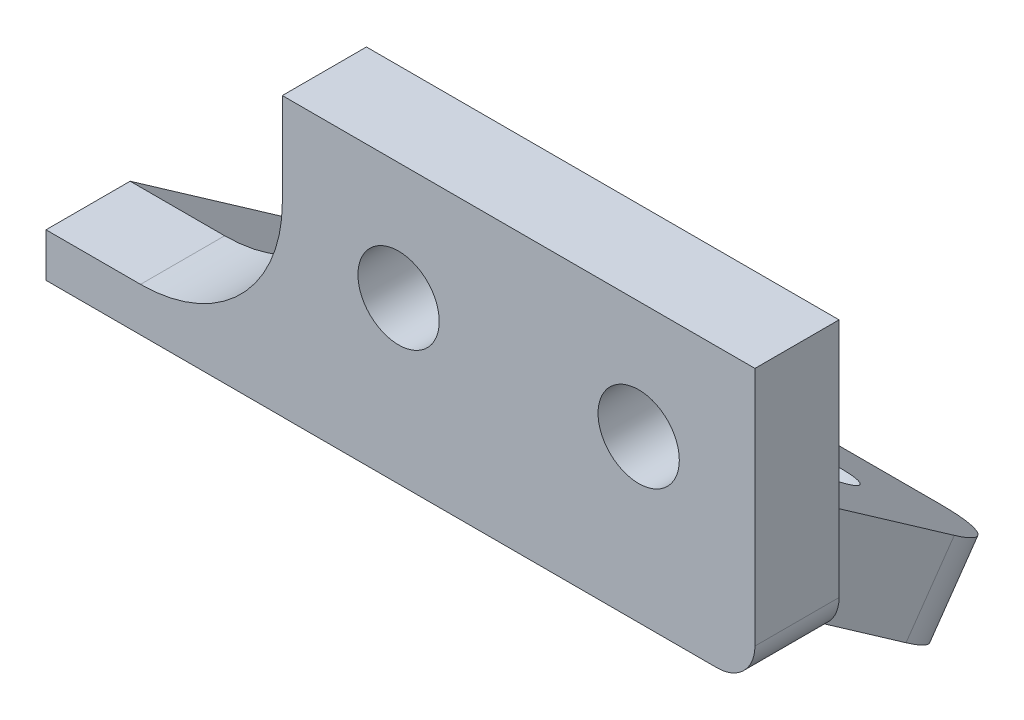
ISO-10303-21;
HEADER;
FILE_DESCRIPTION(('STEP AP214'),'2;1');
FILE_NAME('part.step','',(''),(''),'','','');
FILE_SCHEMA(('AUTOMOTIVE_DESIGN { 1 0 10303 214 1 1 1 1 }'));
ENDSEC;
DATA;
#1=APPLICATION_CONTEXT('core data for automotive mechanical design processes');
#2=APPLICATION_PROTOCOL_DEFINITION('international standard','automotive_design',2000,#1);
#3=PRODUCT_CONTEXT('',#1,'mechanical');
#4=PRODUCT('Part','Part','',(#3));
#5=PRODUCT_RELATED_PRODUCT_CATEGORY('part','',(#4));
#6=PRODUCT_DEFINITION_FORMATION('','',#4);
#7=PRODUCT_DEFINITION_CONTEXT('part definition',#1,'design');
#8=PRODUCT_DEFINITION('design','',#6,#7);
#9=PRODUCT_DEFINITION_SHAPE('','',#8);
#10=(LENGTH_UNIT() NAMED_UNIT(*) SI_UNIT(.MILLI.,.METRE.));
#11=(NAMED_UNIT(*) PLANE_ANGLE_UNIT() SI_UNIT($,.RADIAN.));
#12=(NAMED_UNIT(*) SI_UNIT($,.STERADIAN.) SOLID_ANGLE_UNIT());
#13=UNCERTAINTY_MEASURE_WITH_UNIT(LENGTH_MEASURE(1.E-05),#10,'distance_accuracy_value','');
#14=(GEOMETRIC_REPRESENTATION_CONTEXT(3) GLOBAL_UNCERTAINTY_ASSIGNED_CONTEXT((#13)) GLOBAL_UNIT_ASSIGNED_CONTEXT((#10,
#11,#12)) REPRESENTATION_CONTEXT('',''));
#15=CARTESIAN_POINT('',(0.,0.,0.));
#16=DIRECTION('',(0.,0.,1.));
#17=DIRECTION('',(1.,0.,0.));
#18=AXIS2_PLACEMENT_3D('',#15,#16,#17);
#19=CARTESIAN_POINT('',(0.,0.,-4.45));
#20=DIRECTION('',(0.,0.,1.));
#21=DIRECTION('',(-1.,0.,0.));
#22=AXIS2_PLACEMENT_3D('',#19,#20,#21);
#23=PLANE('',#22);
#24=CARTESIAN_POINT('',(6.35000000000059,0.,-4.45));
#25=DIRECTION('',(0.,0.,1.));
#26=DIRECTION('',(1.,0.,0.));
#27=AXIS2_PLACEMENT_3D('',#24,#25,#26);
#28=CIRCLE('',#27,2.14999999999969);
#29=CARTESIAN_POINT('',(8.50000000000028,0.,-4.45));
#30=VERTEX_POINT('',#29);
#31=EDGE_CURVE('E188',#30,#30,#28,.T.);
#32=ORIENTED_EDGE('',*,*,#31,.T.);
#33=EDGE_LOOP('',(#32));
#34=FACE_BOUND('',#33,.T.);
#35=CARTESIAN_POINT('',(-6.35000000000035,-1.21430643318376E-12,-4.45));
#36=DIRECTION('',(0.,0.,1.));
#37=DIRECTION('',(1.,0.,0.));
#38=AXIS2_PLACEMENT_3D('',#35,#36,#37);
#39=CIRCLE('',#38,2.15000000000069);
#40=CARTESIAN_POINT('',(-4.19999999999966,-1.21430643318376E-12,-4.45));
#41=VERTEX_POINT('',#40);
#42=EDGE_CURVE('E194',#41,#41,#39,.T.);
#43=ORIENTED_EDGE('',*,*,#42,.T.);
#44=EDGE_LOOP('',(#43));
#45=FACE_BOUND('',#44,.T.);
#46=DIRECTION('',(1.,0.,0.));
#47=VECTOR('',#46,1.);
#48=CARTESIAN_POINT('',(12.5000000000001,-8.52,-4.45));
#49=LINE('',#48,#47);
#50=CARTESIAN_POINT('',(7.50000000000012,-8.52,-4.45));
#51=VERTEX_POINT('',#50);
#52=CARTESIAN_POINT('',(10.5000000000001,-8.52,-4.45));
#53=VERTEX_POINT('',#52);
#54=EDGE_CURVE('E203',#51,#53,#49,.T.);
#55=ORIENTED_EDGE('',*,*,#54,.F.);
#56=DIRECTION('',(0.,1.,0.));
#57=VECTOR('',#56,1.);
#58=CARTESIAN_POINT('',(7.50000000000012,-8.52,-4.45));
#59=LINE('',#58,#57);
#60=CARTESIAN_POINT('',(7.50000000000012,-6.2,-4.45));
#61=VERTEX_POINT('',#60);
#62=EDGE_CURVE('E237',#61,#51,#59,.F.);
#63=ORIENTED_EDGE('',*,*,#62,.F.);
#64=DIRECTION('',(1.,0.,0.));
#65=VECTOR('',#64,1.);
#66=CARTESIAN_POINT('',(-24.9999999999999,-6.2,-4.45));
#67=LINE('',#66,#65);
#68=CARTESIAN_POINT('',(-19.9999999999999,-6.2,-4.45));
#69=VERTEX_POINT('',#68);
#70=EDGE_CURVE('E180',#69,#61,#67,.T.);
#71=ORIENTED_EDGE('',*,*,#70,.F.);
#72=CARTESIAN_POINT('',(-19.9999999999999,1.3,-4.45));
#73=DIRECTION('',(0.,0.,-1.));
#74=DIRECTION('',(-1.,0.,0.));
#75=AXIS2_PLACEMENT_3D('',#72,#73,#74);
#76=CIRCLE('',#75,7.5);
#77=CARTESIAN_POINT('',(-12.4999999999999,1.3,-4.45));
#78=VERTEX_POINT('',#77);
#79=EDGE_CURVE('E253',#78,#69,#76,.T.);
#80=ORIENTED_EDGE('',*,*,#79,.F.);
#81=DIRECTION('',(0.,-1.,0.));
#82=VECTOR('',#81,1.);
#83=CARTESIAN_POINT('',(-12.4999999999999,-8.52,-4.45));
#84=LINE('',#83,#82);
#85=CARTESIAN_POINT('',(-12.4999999999999,6.2,-4.45));
#86=VERTEX_POINT('',#85);
#87=EDGE_CURVE('E200',#86,#78,#84,.T.);
#88=ORIENTED_EDGE('',*,*,#87,.F.);
#89=DIRECTION('',(-1.,0.,0.));
#90=VECTOR('',#89,1.);
#91=CARTESIAN_POINT('',(-12.4999999999999,6.2,-4.45));
#92=LINE('',#91,#90);
#93=CARTESIAN_POINT('',(12.5000000000001,6.2,-4.45));
#94=VERTEX_POINT('',#93);
#95=EDGE_CURVE('E209',#94,#86,#92,.T.);
#96=ORIENTED_EDGE('',*,*,#95,.F.);
#97=DIRECTION('',(0.,1.,0.));
#98=VECTOR('',#97,1.);
#99=CARTESIAN_POINT('',(12.5000000000001,6.2,-4.45));
#100=LINE('',#99,#98);
#101=CARTESIAN_POINT('',(12.5000000000001,-6.52,-4.45));
#102=VERTEX_POINT('',#101);
#103=EDGE_CURVE('E206',#102,#94,#100,.T.);
#104=ORIENTED_EDGE('',*,*,#103,.F.);
#105=CARTESIAN_POINT('',(10.5000000000001,-6.52,-4.45));
#106=DIRECTION('',(0.,0.,-1.));
#107=DIRECTION('',(-1.,0.,0.));
#108=AXIS2_PLACEMENT_3D('',#105,#106,#107);
#109=CIRCLE('',#108,2.);
#110=EDGE_CURVE('E11',#53,#102,#109,.F.);
#111=ORIENTED_EDGE('',*,*,#110,.F.);
#112=EDGE_LOOP('',(#55,#63,#71,#80,#88,#96,#104,#111));
#113=FACE_BOUND('',#112,.T.);
#114=ADVANCED_FACE('F43',(#34,#45,#113),#23,.F.);
#115=CARTESIAN_POINT('',(-12.4999999999999,-8.52,-4.45));
#116=DIRECTION('',(1.,0.,0.));
#117=DIRECTION('',(0.,0.,1.));
#118=AXIS2_PLACEMENT_3D('',#115,#116,#117);
#119=PLANE('',#118);
#120=DIRECTION('',(0.,-1.,0.));
#121=VECTOR('',#120,1.);
#122=CARTESIAN_POINT('',(-12.4999999999999,-8.52,0.));
#123=LINE('',#122,#121);
#124=CARTESIAN_POINT('',(-12.4999999999999,6.2,0.));
#125=VERTEX_POINT('',#124);
#126=CARTESIAN_POINT('',(-12.4999999999999,1.3,0.));
#127=VERTEX_POINT('',#126);
#128=EDGE_CURVE('E213',#125,#127,#123,.T.);
#129=ORIENTED_EDGE('',*,*,#128,.F.);
#130=DIRECTION('',(0.,0.,1.));
#131=VECTOR('',#130,1.);
#132=CARTESIAN_POINT('',(-12.4999999999999,6.2,-4.45));
#133=LINE('',#132,#131);
#134=EDGE_CURVE('E212',#86,#125,#133,.T.);
#135=ORIENTED_EDGE('',*,*,#134,.F.);
#136=ORIENTED_EDGE('',*,*,#87,.T.);
#137=DIRECTION('',(0.,0.,1.));
#138=VECTOR('',#137,1.);
#139=CARTESIAN_POINT('',(-12.4999999999999,1.3,-4.45));
#140=LINE('',#139,#138);
#141=EDGE_CURVE('E244',#127,#78,#140,.F.);
#142=ORIENTED_EDGE('',*,*,#141,.F.);
#143=EDGE_LOOP('',(#129,#135,#136,#142));
#144=FACE_BOUND('',#143,.T.);
#145=ADVANCED_FACE('F321',(#144),#119,.F.);
#146=CARTESIAN_POINT('',(0.,0.,0.));
#147=DIRECTION('',(0.,0.,1.));
#148=DIRECTION('',(-1.,0.,0.));
#149=AXIS2_PLACEMENT_3D('',#146,#147,#148);
#150=PLANE('',#149);
#151=DIRECTION('',(0.,1.,0.));
#152=VECTOR('',#151,1.);
#153=CARTESIAN_POINT('',(12.5000000000001,6.2,0.));
#154=LINE('',#153,#152);
#155=CARTESIAN_POINT('',(12.5000000000001,-6.52,0.));
#156=VERTEX_POINT('',#155);
#157=CARTESIAN_POINT('',(12.5000000000001,6.2,0.));
#158=VERTEX_POINT('',#157);
#159=EDGE_CURVE('E219',#156,#158,#154,.T.);
#160=ORIENTED_EDGE('',*,*,#159,.T.);
#161=DIRECTION('',(-1.,0.,0.));
#162=VECTOR('',#161,1.);
#163=CARTESIAN_POINT('',(-12.4999999999999,6.2,0.));
#164=LINE('',#163,#162);
#165=EDGE_CURVE('E204',#158,#125,#164,.T.);
#166=ORIENTED_EDGE('',*,*,#165,.T.);
#167=ORIENTED_EDGE('',*,*,#128,.T.);
#168=CARTESIAN_POINT('',(-19.9999999999999,1.3,0.));
#169=DIRECTION('',(0.,0.,-1.));
#170=DIRECTION('',(-1.,0.,0.));
#171=AXIS2_PLACEMENT_3D('',#168,#169,#170);
#172=CIRCLE('',#171,7.5);
#173=CARTESIAN_POINT('',(-19.9999999999999,-6.2,0.));
#174=VERTEX_POINT('',#173);
#175=EDGE_CURVE('E251',#174,#127,#172,.F.);
#176=ORIENTED_EDGE('',*,*,#175,.F.);
#177=DIRECTION('',(1.,0.,0.));
#178=VECTOR('',#177,1.);
#179=CARTESIAN_POINT('',(-24.9999999999999,-6.2,0.));
#180=LINE('',#179,#178);
#181=CARTESIAN_POINT('',(-24.9999999999999,-6.2,0.));
#182=VERTEX_POINT('',#181);
#183=EDGE_CURVE('E184',#182,#174,#180,.T.);
#184=ORIENTED_EDGE('',*,*,#183,.F.);
#185=DIRECTION('',(0.,-1.,0.));
#186=VECTOR('',#185,1.);
#187=CARTESIAN_POINT('',(-24.9999999999999,0.,0.));
#188=LINE('',#187,#186);
#189=CARTESIAN_POINT('',(-24.9999999999999,-8.51652337495525,0.));
#190=VERTEX_POINT('',#189);
#191=EDGE_CURVE('E172',#182,#190,#188,.T.);
#192=ORIENTED_EDGE('',*,*,#191,.T.);
#193=DIRECTION('',(1.,0.,0.));
#194=VECTOR('',#193,1.);
#195=CARTESIAN_POINT('',(-24.9999999999999,-8.51652337495525,0.));
#196=LINE('',#195,#194);
#197=CARTESIAN_POINT('',(-12.4999999999999,-8.51652337495525,0.));
#198=VERTEX_POINT('',#197);
#199=EDGE_CURVE('E298',#190,#198,#196,.T.);
#200=ORIENTED_EDGE('',*,*,#199,.T.);
#201=CARTESIAN_POINT('',(-12.4999999999999,-8.52,0.));
#202=VERTEX_POINT('',#201);
#203=EDGE_CURVE('E197',#198,#202,#123,.T.);
#204=ORIENTED_EDGE('',*,*,#203,.T.);
#205=DIRECTION('',(1.,0.,0.));
#206=VECTOR('',#205,1.);
#207=CARTESIAN_POINT('',(12.5000000000001,-8.52,0.));
#208=LINE('',#207,#206);
#209=CARTESIAN_POINT('',(10.5000000000001,-8.52,0.));
#210=VERTEX_POINT('',#209);
#211=EDGE_CURVE('E216',#202,#210,#208,.T.);
#212=ORIENTED_EDGE('',*,*,#211,.T.);
#213=CARTESIAN_POINT('',(10.5000000000001,-6.52,0.));
#214=DIRECTION('',(0.,0.,-1.));
#215=DIRECTION('',(-1.,0.,0.));
#216=AXIS2_PLACEMENT_3D('',#213,#214,#215);
#217=CIRCLE('',#216,2.);
#218=EDGE_CURVE('E277',#156,#210,#217,.T.);
#219=ORIENTED_EDGE('',*,*,#218,.F.);
#220=EDGE_LOOP('',(#160,#166,#167,#176,#184,#192,#200,#204,#212,#219));
#221=FACE_BOUND('',#220,.T.);
#222=CARTESIAN_POINT('',(-6.35000000000035,-1.21430643318376E-12,0.));
#223=DIRECTION('',(0.,0.,1.));
#224=DIRECTION('',(1.,0.,0.));
#225=AXIS2_PLACEMENT_3D('',#222,#223,#224);
#226=CIRCLE('',#225,2.15000000000069);
#227=CARTESIAN_POINT('',(-4.19999999999966,-1.21430643318376E-12,0.));
#228=VERTEX_POINT('',#227);
#229=EDGE_CURVE('E191',#228,#228,#226,.T.);
#230=ORIENTED_EDGE('',*,*,#229,.F.);
#231=EDGE_LOOP('',(#230));
#232=FACE_BOUND('',#231,.T.);
#233=CARTESIAN_POINT('',(6.35000000000059,0.,0.));
#234=DIRECTION('',(0.,0.,1.));
#235=DIRECTION('',(1.,0.,0.));
#236=AXIS2_PLACEMENT_3D('',#233,#234,#235);
#237=CIRCLE('',#236,2.14999999999969);
#238=CARTESIAN_POINT('',(8.50000000000028,0.,0.));
#239=VERTEX_POINT('',#238);
#240=EDGE_CURVE('E182',#239,#239,#237,.T.);
#241=ORIENTED_EDGE('',*,*,#240,.F.);
#242=EDGE_LOOP('',(#241));
#243=FACE_BOUND('',#242,.T.);
#244=ADVANCED_FACE('F282',(#221,#232,#243),#150,.T.);
#245=DIRECTION('',(0.,0.,1.));
#246=VECTOR('',#245,1.);
#247=CARTESIAN_POINT('',(-12.4999999999999,-8.52,-4.45));
#248=LINE('',#247,#246);
#249=CARTESIAN_POINT('',(-12.4999999999999,-8.52,-0.00496513512784555));
#250=VERTEX_POINT('',#249);
#251=EDGE_CURVE('E227',#250,#202,#248,.T.);
#252=ORIENTED_EDGE('',*,*,#251,.T.);
#253=ORIENTED_EDGE('',*,*,#203,.F.);
#254=DIRECTION('',(0.,0.57357643635105,0.819152044288989));
#255=VECTOR('',#254,1.);
#256=CARTESIAN_POINT('',(-12.4999999999999,-10.6084832308282,-2.98762829834949));
#257=LINE('',#256,#255);
#258=EDGE_CURVE('E179',#250,#198,#257,.T.);
#259=ORIENTED_EDGE('',*,*,#258,.F.);
#260=EDGE_LOOP('',(#252,#253,#259));
#261=FACE_BOUND('',#260,.T.);
#262=ADVANCED_FACE('F292',(#261),#119,.F.);
#263=CARTESIAN_POINT('',(12.5000000000001,-8.52,-4.45));
#264=DIRECTION('',(0.,1.,0.));
#265=DIRECTION('',(0.,0.,-1.));
#266=AXIS2_PLACEMENT_3D('',#263,#264,#265);
#267=PLANE('',#266);
#268=ORIENTED_EDGE('',*,*,#211,.F.);
#269=ORIENTED_EDGE('',*,*,#251,.F.);
#270=DIRECTION('',(-1.,0.,0.));
#271=VECTOR('',#270,1.);
#272=CARTESIAN_POINT('',(12.5000000000001,-8.52,-0.00496513512784555));
#273=LINE('',#272,#271);
#274=CARTESIAN_POINT('',(7.50000000000012,-8.52,-0.00496513512784555));
#275=VERTEX_POINT('',#274);
#276=EDGE_CURVE('E229',#275,#250,#273,.T.);
#277=ORIENTED_EDGE('',*,*,#276,.F.);
#278=DIRECTION('',(0.,0.,-1.));
#279=VECTOR('',#278,1.);
#280=CARTESIAN_POINT('',(7.50000000000012,-8.52,-0.00496513512784468));
#281=LINE('',#280,#279);
#282=EDGE_CURVE('E240',#51,#275,#281,.F.);
#283=ORIENTED_EDGE('',*,*,#282,.F.);
#284=ORIENTED_EDGE('',*,*,#54,.T.);
#285=DIRECTION('',(0.,0.,1.));
#286=VECTOR('',#285,1.);
#287=CARTESIAN_POINT('',(10.5000000000001,-8.52,-4.45));
#288=LINE('',#287,#286);
#289=EDGE_CURVE('E51',#210,#53,#288,.F.);
#290=ORIENTED_EDGE('',*,*,#289,.F.);
#291=EDGE_LOOP('',(#268,#269,#277,#283,#284,#290));
#292=FACE_BOUND('',#291,.T.);
#293=ADVANCED_FACE('F287',(#292),#267,.F.);
#294=CARTESIAN_POINT('',(12.5000000000001,6.2,-4.45));
#295=DIRECTION('',(-1.,0.,0.));
#296=DIRECTION('',(0.,0.,-1.));
#297=AXIS2_PLACEMENT_3D('',#294,#295,#296);
#298=PLANE('',#297);
#299=ORIENTED_EDGE('',*,*,#103,.T.);
#300=DIRECTION('',(0.,0.,1.));
#301=VECTOR('',#300,1.);
#302=CARTESIAN_POINT('',(12.5000000000001,6.2,-4.45));
#303=LINE('',#302,#301);
#304=EDGE_CURVE('E225',#94,#158,#303,.T.);
#305=ORIENTED_EDGE('',*,*,#304,.T.);
#306=ORIENTED_EDGE('',*,*,#159,.F.);
#307=DIRECTION('',(0.,0.,1.));
#308=VECTOR('',#307,1.);
#309=CARTESIAN_POINT('',(12.5000000000001,-6.52,-4.45));
#310=LINE('',#309,#308);
#311=EDGE_CURVE('E275',#102,#156,#310,.T.);
#312=ORIENTED_EDGE('',*,*,#311,.F.);
#313=EDGE_LOOP('',(#299,#305,#306,#312));
#314=FACE_BOUND('',#313,.T.);
#315=ADVANCED_FACE('F313',(#314),#298,.F.);
#316=CARTESIAN_POINT('',(-12.4999999999999,6.2,-4.45));
#317=DIRECTION('',(0.,-1.,0.));
#318=DIRECTION('',(0.,0.,1.));
#319=AXIS2_PLACEMENT_3D('',#316,#317,#318);
#320=PLANE('',#319);
#321=ORIENTED_EDGE('',*,*,#165,.F.);
#322=ORIENTED_EDGE('',*,*,#304,.F.);
#323=ORIENTED_EDGE('',*,*,#95,.T.);
#324=ORIENTED_EDGE('',*,*,#134,.T.);
#325=EDGE_LOOP('',(#321,#322,#323,#324));
#326=FACE_BOUND('',#325,.T.);
#327=ADVANCED_FACE('F318',(#326),#320,.F.);
#328=CARTESIAN_POINT('',(-6.35000000000035,-1.21430643318376E-12,-4.45));
#329=DIRECTION('',(0.,0.,1.));
#330=DIRECTION('',(-1.,0.,0.));
#331=AXIS2_PLACEMENT_3D('',#328,#329,#330);
#332=CYLINDRICAL_SURFACE('',#331,2.15000000000069);
#333=ORIENTED_EDGE('',*,*,#42,.F.);
#334=EDGE_LOOP('',(#333));
#335=FACE_BOUND('',#334,.T.);
#336=ORIENTED_EDGE('',*,*,#229,.T.);
#337=EDGE_LOOP('',(#336));
#338=FACE_BOUND('',#337,.T.);
#339=ADVANCED_FACE('F392',(#335,#338),#332,.F.);
#340=CARTESIAN_POINT('',(6.35000000000059,0.,-4.45));
#341=DIRECTION('',(0.,0.,1.));
#342=DIRECTION('',(-1.,0.,0.));
#343=AXIS2_PLACEMENT_3D('',#340,#341,#342);
#344=CYLINDRICAL_SURFACE('',#343,2.14999999999969);
#345=ORIENTED_EDGE('',*,*,#31,.F.);
#346=EDGE_LOOP('',(#345));
#347=FACE_BOUND('',#346,.T.);
#348=ORIENTED_EDGE('',*,*,#240,.T.);
#349=EDGE_LOOP('',(#348));
#350=FACE_BOUND('',#349,.T.);
#351=ADVANCED_FACE('F444',(#347,#350),#344,.F.);
#352=CARTESIAN_POINT('',(-24.9999999999999,-6.2,0.));
#353=DIRECTION('',(0.,-1.,0.));
#354=DIRECTION('',(0.,0.,1.));
#355=AXIS2_PLACEMENT_3D('',#352,#353,#354);
#356=PLANE('',#355);
#357=CARTESIAN_POINT('',(-24.9999999999999,-6.2,-4.45));
#358=VERTEX_POINT('',#357);
#359=EDGE_CURVE('E161',#358,#69,#67,.T.);
#360=ORIENTED_EDGE('',*,*,#359,.F.);
#361=DIRECTION('',(0.,0.,1.));
#362=VECTOR('',#361,1.);
#363=CARTESIAN_POINT('',(-24.9999999999999,-6.2,0.));
#364=LINE('',#363,#362);
#365=EDGE_CURVE('E166',#358,#182,#364,.T.);
#366=ORIENTED_EDGE('',*,*,#365,.T.);
#367=ORIENTED_EDGE('',*,*,#183,.T.);
#368=DIRECTION('',(0.,0.,1.));
#369=VECTOR('',#368,1.);
#370=CARTESIAN_POINT('',(-19.9999999999999,-6.2,0.));
#371=LINE('',#370,#369);
#372=EDGE_CURVE('E178',#69,#174,#371,.T.);
#373=ORIENTED_EDGE('',*,*,#372,.F.);
#374=EDGE_LOOP('',(#360,#366,#367,#373));
#375=FACE_BOUND('',#374,.T.);
#376=ADVANCED_FACE('F177',(#375),#356,.F.);
#377=CARTESIAN_POINT('',(-24.9999999999999,-5.71467296014689,4.00145708509809));
#378=DIRECTION('',(0.,-0.819152044288989,0.57357643635105));
#379=DIRECTION('',(0.,0.57357643635105,0.819152044288989));
#380=AXIS2_PLACEMENT_3D('',#377,#378,#379);
#381=PLANE('',#380);
#382=CARTESIAN_POINT('',(-6.19999999999988,-14.5485533751646,-8.61463162140754));
#383=DIRECTION('',(0.,0.819152044288989,-0.57357643635105));
#384=DIRECTION('',(0.,0.57357643635105,0.819152044288989));
#385=AXIS2_PLACEMENT_3D('',#382,#383,#384);
#386=CIRCLE('',#385,2.15);
#387=CARTESIAN_POINT('',(-6.19999999999988,-13.3153640370099,-6.85345472618621));
#388=VERTEX_POINT('',#387);
#389=EDGE_CURVE('E339',#388,#388,#386,.T.);
#390=ORIENTED_EDGE('',*,*,#389,.T.);
#391=EDGE_LOOP('',(#390));
#392=FACE_BOUND('',#391,.T.);
#393=CARTESIAN_POINT('',(-18.7999999999999,-21.7756164731878,-18.9359473794488));
#394=DIRECTION('',(0.,0.819152044288989,-0.57357643635105));
#395=DIRECTION('',(0.,0.57357643635105,0.819152044288989));
#396=AXIS2_PLACEMENT_3D('',#393,#394,#395);
#397=CIRCLE('',#396,2.15);
#398=CARTESIAN_POINT('',(-18.7999999999999,-20.5424271350331,-17.1747704842275));
#399=VERTEX_POINT('',#398);
#400=EDGE_CURVE('E342',#399,#399,#397,.T.);
#401=ORIENTED_EDGE('',*,*,#400,.T.);
#402=EDGE_LOOP('',(#401));
#403=FACE_BOUND('',#402,.T.);
#404=CARTESIAN_POINT('',(-6.19999999999988,-21.7756164731878,-18.9359473794488));
#405=DIRECTION('',(0.,0.819152044288989,-0.57357643635105));
#406=DIRECTION('',(0.,0.57357643635105,0.819152044288989));
#407=AXIS2_PLACEMENT_3D('',#404,#405,#406);
#408=CIRCLE('',#407,2.15);
#409=CARTESIAN_POINT('',(-6.19999999999988,-20.5424271350331,-17.1747704842275));
#410=VERTEX_POINT('',#409);
#411=EDGE_CURVE('E345',#410,#410,#408,.T.);
#412=ORIENTED_EDGE('',*,*,#411,.T.);
#413=EDGE_LOOP('',(#412));
#414=FACE_BOUND('',#413,.T.);
#415=CARTESIAN_POINT('',(-18.7999999999999,-14.5485533751646,-8.61463162140754));
#416=DIRECTION('',(0.,0.819152044288989,-0.57357643635105));
#417=DIRECTION('',(0.,0.57357643635105,0.819152044288989));
#418=AXIS2_PLACEMENT_3D('',#415,#416,#417);
#419=CIRCLE('',#418,2.15);
#420=CARTESIAN_POINT('',(-18.7999999999999,-13.3153640370099,-6.85345472618622));
#421=VERTEX_POINT('',#420);
#422=EDGE_CURVE('E348',#421,#421,#419,.T.);
#423=ORIENTED_EDGE('',*,*,#422,.T.);
#424=EDGE_LOOP('',(#423));
#425=FACE_BOUND('',#424,.T.);
#426=DIRECTION('',(0.,0.57357643635105,0.819152044288989));
#427=VECTOR('',#426,1.);
#428=CARTESIAN_POINT('',(1.21430643318376E-13,-5.71467296014689,4.00145708509809));
#429=LINE('',#428,#427);
#430=CARTESIAN_POINT('',(1.21430643318376E-13,-22.8654117022548,-20.4923362635979));
#431=VERTEX_POINT('',#430);
#432=CARTESIAN_POINT('',(1.21430643318376E-13,-16.02,-10.7160751856936));
#433=VERTEX_POINT('',#432);
#434=EDGE_CURVE('E167',#431,#433,#429,.T.);
#435=ORIENTED_EDGE('',*,*,#434,.T.);
#436=CARTESIAN_POINT('',(7.50000000000012,-16.02,-10.7160751856936));
#437=DIRECTION('',(0.,0.819152044288989,-0.57357643635105));
#438=DIRECTION('',(0.,0.57357643635105,0.819152044288989));
#439=AXIS2_PLACEMENT_3D('',#436,#437,#438);
#440=ELLIPSE('',#439,13.0758509671581,7.5);
#441=EDGE_CURVE('E248',#275,#433,#440,.F.);
#442=ORIENTED_EDGE('',*,*,#441,.F.);
#443=ORIENTED_EDGE('',*,*,#276,.T.);
#444=ORIENTED_EDGE('',*,*,#258,.T.);
#445=ORIENTED_EDGE('',*,*,#199,.F.);
#446=DIRECTION('',(0.,0.57357643635105,0.819152044288989));
#447=VECTOR('',#446,1.);
#448=CARTESIAN_POINT('',(-24.9999999999999,-5.71467296014689,4.00145708509809));
#449=LINE('',#448,#447);
#450=CARTESIAN_POINT('',(-24.9999999999999,-22.8654117022548,-20.4923362635979));
#451=VERTEX_POINT('',#450);
#452=EDGE_CURVE('E332',#451,#190,#449,.T.);
#453=ORIENTED_EDGE('',*,*,#452,.F.);
#454=CARTESIAN_POINT('',(-20.6999999999999,-22.8654117022548,-20.4923362635979));
#455=DIRECTION('',(0.,0.819152044288989,-0.57357643635105));
#456=DIRECTION('',(0.,0.57357643635105,0.819152044288989));
#457=AXIS2_PLACEMENT_3D('',#454,#455,#456);
#458=CIRCLE('',#457,4.3);
#459=CARTESIAN_POINT('',(-20.6999999999999,-25.3317903785643,-24.0146900540405));
#460=VERTEX_POINT('',#459);
#461=EDGE_CURVE('E260',#460,#451,#458,.T.);
#462=ORIENTED_EDGE('',*,*,#461,.F.);
#463=DIRECTION('',(1.,0.,0.));
#464=VECTOR('',#463,1.);
#465=CARTESIAN_POINT('',(-24.9999999999999,-25.3317903785643,-24.0146900540405));
#466=LINE('',#465,#464);
#467=CARTESIAN_POINT('',(-4.29999999999988,-25.3317903785643,-24.0146900540405));
#468=VERTEX_POINT('',#467);
#469=EDGE_CURVE('E325',#460,#468,#466,.T.);
#470=ORIENTED_EDGE('',*,*,#469,.T.);
#471=CARTESIAN_POINT('',(-4.29999999999988,-22.8654117022548,-20.4923362635979));
#472=DIRECTION('',(0.,0.819152044288989,-0.57357643635105));
#473=DIRECTION('',(0.,0.57357643635105,0.819152044288989));
#474=AXIS2_PLACEMENT_3D('',#471,#472,#473);
#475=CIRCLE('',#474,4.3);
#476=EDGE_CURVE('E263',#431,#468,#475,.T.);
#477=ORIENTED_EDGE('',*,*,#476,.F.);
#478=EDGE_LOOP('',(#435,#442,#443,#444,#445,#453,#462,#470,#477));
#479=FACE_BOUND('',#478,.T.);
#480=ADVANCED_FACE('F296',(#392,#403,#414,#425,#479),#381,.T.);
#481=CARTESIAN_POINT('',(1.21430643318376E-13,0.,0.));
#482=DIRECTION('',(-1.,0.,0.));
#483=DIRECTION('',(0.,0.,-1.));
#484=AXIS2_PLACEMENT_3D('',#481,#482,#483);
#485=PLANE('',#484);
#486=DIRECTION('',(0.,-0.57357643635105,-0.819152044288989));
#487=VECTOR('',#486,1.);
#488=CARTESIAN_POINT('',(1.21430643318376E-13,-2.06944636306089,1.44904194333592));
#489=LINE('',#488,#487);
#490=CARTESIAN_POINT('',(1.21430643318376E-13,-11.4515565365729,-11.95));
#491=VERTEX_POINT('',#490);
#492=CARTESIAN_POINT('',(1.21430643318376E-13,-19.2201851051688,-23.04475140536));
#493=VERTEX_POINT('',#492);
#494=EDGE_CURVE('E336',#491,#493,#489,.T.);
#495=ORIENTED_EDGE('',*,*,#494,.F.);
#496=DIRECTION('',(0.,1.,0.));
#497=VECTOR('',#496,1.);
#498=CARTESIAN_POINT('',(1.21430643318376E-13,-6.2,-11.95));
#499=LINE('',#498,#497);
#500=CARTESIAN_POINT('',(1.21430643318376E-13,-16.02,-11.95));
#501=VERTEX_POINT('',#500);
#502=EDGE_CURVE('E234',#501,#491,#499,.T.);
#503=ORIENTED_EDGE('',*,*,#502,.F.);
#504=DIRECTION('',(0.,0.,-1.));
#505=VECTOR('',#504,1.);
#506=CARTESIAN_POINT('',(1.21430643318376E-13,-16.02,-4.45));
#507=LINE('',#506,#505);
#508=EDGE_CURVE('E231',#433,#501,#507,.T.);
#509=ORIENTED_EDGE('',*,*,#508,.F.);
#510=ORIENTED_EDGE('',*,*,#434,.F.);
#511=DIRECTION('',(0.,-0.819152044288989,0.573576436351051));
#512=VECTOR('',#511,1.);
#513=CARTESIAN_POINT('',(1.21430643318376E-13,-22.8654117022548,-20.4923362635979));
#514=LINE('',#513,#512);
#515=EDGE_CURVE('E255',#493,#431,#514,.T.);
#516=ORIENTED_EDGE('',*,*,#515,.F.);
#517=EDGE_LOOP('',(#495,#503,#509,#510,#516));
#518=FACE_BOUND('',#517,.T.);
#519=ADVANCED_FACE('F426',(#518),#485,.F.);
#520=CARTESIAN_POINT('',(-24.9999999999999,-2.06944636306089,1.44904194333592));
#521=DIRECTION('',(0.,0.819152044288989,-0.57357643635105));
#522=DIRECTION('',(0.,-0.57357643635105,-0.819152044288989));
#523=AXIS2_PLACEMENT_3D('',#520,#521,#522);
#524=PLANE('',#523);
#525=CARTESIAN_POINT('',(-6.19999999999988,-10.9033267780786,-11.1670467631697));
#526=DIRECTION('',(0.,-0.819152044288989,0.57357643635105));
#527=DIRECTION('',(0.,-0.57357643635105,-0.819152044288989));
#528=AXIS2_PLACEMENT_3D('',#525,#526,#527);
#529=CIRCLE('',#528,2.15);
#530=CARTESIAN_POINT('',(-6.19999999999988,-12.1365161162334,-12.928223658391));
#531=VERTEX_POINT('',#530);
#532=EDGE_CURVE('E354',#531,#531,#529,.T.);
#533=ORIENTED_EDGE('',*,*,#532,.T.);
#534=EDGE_LOOP('',(#533));
#535=FACE_BOUND('',#534,.T.);
#536=CARTESIAN_POINT('',(-18.7999999999999,-18.1303898761018,-21.488362521211));
#537=DIRECTION('',(0.,-0.819152044288989,0.57357643635105));
#538=DIRECTION('',(0.,-0.57357643635105,-0.819152044288989));
#539=AXIS2_PLACEMENT_3D('',#536,#537,#538);
#540=CIRCLE('',#539,2.15);
#541=CARTESIAN_POINT('',(-18.7999999999999,-19.3635792142566,-23.2495394164323));
#542=VERTEX_POINT('',#541);
#543=EDGE_CURVE('E355',#542,#542,#540,.T.);
#544=ORIENTED_EDGE('',*,*,#543,.T.);
#545=EDGE_LOOP('',(#544));
#546=FACE_BOUND('',#545,.T.);
#547=CARTESIAN_POINT('',(-6.19999999999988,-18.1303898761018,-21.488362521211));
#548=DIRECTION('',(0.,-0.819152044288989,0.57357643635105));
#549=DIRECTION('',(0.,-0.57357643635105,-0.819152044288989));
#550=AXIS2_PLACEMENT_3D('',#547,#548,#549);
#551=CIRCLE('',#550,2.15);
#552=CARTESIAN_POINT('',(-6.19999999999988,-19.3635792142566,-23.2495394164323));
#553=VERTEX_POINT('',#552);
#554=EDGE_CURVE('E258',#553,#553,#551,.T.);
#555=ORIENTED_EDGE('',*,*,#554,.T.);
#556=EDGE_LOOP('',(#555));
#557=FACE_BOUND('',#556,.T.);
#558=CARTESIAN_POINT('',(-18.7999999999999,-10.9033267780786,-11.1670467631697));
#559=DIRECTION('',(0.,-0.819152044288989,0.57357643635105));
#560=DIRECTION('',(0.,-0.57357643635105,-0.819152044288989));
#561=AXIS2_PLACEMENT_3D('',#558,#559,#560);
#562=CIRCLE('',#561,2.15);
#563=CARTESIAN_POINT('',(-18.7999999999999,-12.1365161162334,-12.928223658391));
#564=VERTEX_POINT('',#563);
#565=EDGE_CURVE('E351',#564,#564,#562,.T.);
#566=ORIENTED_EDGE('',*,*,#565,.T.);
#567=EDGE_LOOP('',(#566));
#568=FACE_BOUND('',#567,.T.);
#569=DIRECTION('',(1.,0.,0.));
#570=VECTOR('',#569,1.);
#571=CARTESIAN_POINT('',(-24.9999999999999,-21.6865637814783,-26.5671051958027));
#572=LINE('',#571,#570);
#573=CARTESIAN_POINT('',(-20.6999999999999,-21.6865637814783,-26.5671051958027));
#574=VERTEX_POINT('',#573);
#575=CARTESIAN_POINT('',(-4.29999999999988,-21.6865637814783,-26.5671051958027));
#576=VERTEX_POINT('',#575);
#577=EDGE_CURVE('E327',#574,#576,#572,.T.);
#578=ORIENTED_EDGE('',*,*,#577,.F.);
#579=CARTESIAN_POINT('',(-20.6999999999999,-19.2201851051688,-23.04475140536));
#580=DIRECTION('',(0.,-0.819152044288989,0.57357643635105));
#581=DIRECTION('',(0.,-0.57357643635105,-0.819152044288989));
#582=AXIS2_PLACEMENT_3D('',#579,#580,#581);
#583=CIRCLE('',#582,4.3);
#584=CARTESIAN_POINT('',(-24.9999999999999,-19.2201851051688,-23.04475140536));
#585=VERTEX_POINT('',#584);
#586=EDGE_CURVE('E164',#585,#574,#583,.T.);
#587=ORIENTED_EDGE('',*,*,#586,.F.);
#588=DIRECTION('',(0.,-0.57357643635105,-0.819152044288989));
#589=VECTOR('',#588,1.);
#590=CARTESIAN_POINT('',(-24.9999999999999,-2.06944636306089,1.44904194333592));
#591=LINE('',#590,#589);
#592=EDGE_CURVE('E155',#358,#585,#591,.T.);
#593=ORIENTED_EDGE('',*,*,#592,.F.);
#594=ORIENTED_EDGE('',*,*,#359,.T.);
#595=ORIENTED_EDGE('',*,*,#70,.T.);
#596=CARTESIAN_POINT('',(7.50000000000012,-11.4515565365729,-11.95));
#597=DIRECTION('',(0.,-0.819152044288989,0.57357643635105));
#598=DIRECTION('',(0.,-0.57357643635105,-0.819152044288989));
#599=AXIS2_PLACEMENT_3D('',#596,#597,#598);
#600=ELLIPSE('',#599,9.15580941571095,7.5);
#601=EDGE_CURVE('E246',#491,#61,#600,.F.);
#602=ORIENTED_EDGE('',*,*,#601,.F.);
#603=ORIENTED_EDGE('',*,*,#494,.T.);
#604=CARTESIAN_POINT('',(-4.29999999999988,-19.2201851051688,-23.0447514053601));
#605=DIRECTION('',(0.,-0.819152044288989,0.57357643635105));
#606=DIRECTION('',(0.,-0.57357643635105,-0.819152044288989));
#607=AXIS2_PLACEMENT_3D('',#604,#605,#606);
#608=CIRCLE('',#607,4.3);
#609=EDGE_CURVE('E271',#576,#493,#608,.T.);
#610=ORIENTED_EDGE('',*,*,#609,.F.);
#611=EDGE_LOOP('',(#578,#587,#593,#594,#595,#602,#603,#610));
#612=FACE_BOUND('',#611,.T.);
#613=ADVANCED_FACE('F158',(#535,#546,#557,#568,#612),#524,.T.);
#614=CARTESIAN_POINT('',(-24.9999999999999,-19.6171174184175,-28.0161471391386));
#615=DIRECTION('',(0.,-0.57357643635105,-0.819152044288988));
#616=DIRECTION('',(0.,-0.819152044288989,0.573576436351051));
#617=AXIS2_PLACEMENT_3D('',#614,#615,#616);
#618=PLANE('',#617);
#619=ORIENTED_EDGE('',*,*,#469,.F.);
#620=DIRECTION('',(0.,-0.819152044288989,0.573576436351051));
#621=VECTOR('',#620,1.);
#622=CARTESIAN_POINT('',(-20.6999999999999,-19.6171174184175,-28.0161471391386));
#623=LINE('',#622,#621);
#624=EDGE_CURVE('E266',#574,#460,#623,.T.);
#625=ORIENTED_EDGE('',*,*,#624,.F.);
#626=ORIENTED_EDGE('',*,*,#577,.T.);
#627=DIRECTION('',(0.,-0.819152044288989,0.573576436351051));
#628=VECTOR('',#627,1.);
#629=CARTESIAN_POINT('',(-4.29999999999988,-21.6865637814783,-26.5671051958027));
#630=LINE('',#629,#628);
#631=EDGE_CURVE('E268',#468,#576,#630,.F.);
#632=ORIENTED_EDGE('',*,*,#631,.F.);
#633=EDGE_LOOP('',(#619,#625,#626,#632));
#634=FACE_BOUND('',#633,.T.);
#635=ADVANCED_FACE('F421',(#634),#618,.T.);
#636=CARTESIAN_POINT('',(-24.9999999999999,0.,0.));
#637=DIRECTION('',(-1.,0.,0.));
#638=DIRECTION('',(0.,0.,-1.));
#639=AXIS2_PLACEMENT_3D('',#636,#637,#638);
#640=PLANE('',#639);
#641=ORIENTED_EDGE('',*,*,#452,.T.);
#642=ORIENTED_EDGE('',*,*,#191,.F.);
#643=ORIENTED_EDGE('',*,*,#365,.F.);
#644=ORIENTED_EDGE('',*,*,#592,.T.);
#645=DIRECTION('',(0.,-0.819152044288989,0.573576436351051));
#646=VECTOR('',#645,1.);
#647=CARTESIAN_POINT('',(-24.9999999999999,-17.150738742108,-24.493793348696));
#648=LINE('',#647,#646);
#649=EDGE_CURVE('E273',#451,#585,#648,.F.);
#650=ORIENTED_EDGE('',*,*,#649,.F.);
#651=EDGE_LOOP('',(#641,#642,#643,#644,#650));
#652=FACE_BOUND('',#651,.T.);
#653=ADVANCED_FACE('F170',(#652),#640,.T.);
#654=CARTESIAN_POINT('',(-18.7999999999999,-25.831766892286,-0.714040461489394));
#655=DIRECTION('',(0.,0.819152044288989,-0.57357643635105));
#656=DIRECTION('',(0.,-0.57357643635105,-0.819152044288989));
#657=AXIS2_PLACEMENT_3D('',#654,#655,#656);
#658=CYLINDRICAL_SURFACE('',#657,2.15);
#659=ORIENTED_EDGE('',*,*,#422,.F.);
#660=EDGE_LOOP('',(#659));
#661=FACE_BOUND('',#660,.T.);
#662=ORIENTED_EDGE('',*,*,#565,.F.);
#663=EDGE_LOOP('',(#662));
#664=FACE_BOUND('',#663,.T.);
#665=ADVANCED_FACE('F368',(#661,#664),#658,.F.);
#666=CARTESIAN_POINT('',(-6.19999999999988,-33.0588299903092,-11.0353562195307));
#667=DIRECTION('',(0.,0.819152044288989,-0.57357643635105));
#668=DIRECTION('',(0.,-0.57357643635105,-0.819152044288989));
#669=AXIS2_PLACEMENT_3D('',#666,#667,#668);
#670=CYLINDRICAL_SURFACE('',#669,2.15);
#671=ORIENTED_EDGE('',*,*,#411,.F.);
#672=EDGE_LOOP('',(#671));
#673=FACE_BOUND('',#672,.T.);
#674=ORIENTED_EDGE('',*,*,#554,.F.);
#675=EDGE_LOOP('',(#674));
#676=FACE_BOUND('',#675,.T.);
#677=ADVANCED_FACE('F365',(#673,#676),#670,.F.);
#678=CARTESIAN_POINT('',(-18.7999999999999,-33.0588299903092,-11.0353562195307));
#679=DIRECTION('',(0.,0.819152044288989,-0.57357643635105));
#680=DIRECTION('',(0.,-0.57357643635105,-0.819152044288989));
#681=AXIS2_PLACEMENT_3D('',#678,#679,#680);
#682=CYLINDRICAL_SURFACE('',#681,2.15);
#683=ORIENTED_EDGE('',*,*,#400,.F.);
#684=EDGE_LOOP('',(#683));
#685=FACE_BOUND('',#684,.T.);
#686=ORIENTED_EDGE('',*,*,#543,.F.);
#687=EDGE_LOOP('',(#686));
#688=FACE_BOUND('',#687,.T.);
#689=ADVANCED_FACE('F367',(#685,#688),#682,.F.);
#690=CARTESIAN_POINT('',(-6.19999999999988,-25.831766892286,-0.714040461489396));
#691=DIRECTION('',(0.,0.819152044288989,-0.57357643635105));
#692=DIRECTION('',(0.,-0.57357643635105,-0.819152044288989));
#693=AXIS2_PLACEMENT_3D('',#690,#691,#692);
#694=CYLINDRICAL_SURFACE('',#693,2.15);
#695=ORIENTED_EDGE('',*,*,#389,.F.);
#696=EDGE_LOOP('',(#695));
#697=FACE_BOUND('',#696,.T.);
#698=ORIENTED_EDGE('',*,*,#532,.F.);
#699=EDGE_LOOP('',(#698));
#700=FACE_BOUND('',#699,.T.);
#701=ADVANCED_FACE('F375',(#697,#700),#694,.F.);
#702=CARTESIAN_POINT('',(7.50000000000012,-16.02,0.));
#703=DIRECTION('',(0.,0.,1.));
#704=DIRECTION('',(-1.,0.,0.));
#705=AXIS2_PLACEMENT_3D('',#702,#703,#704);
#706=CYLINDRICAL_SURFACE('',#705,7.5);
#707=ORIENTED_EDGE('',*,*,#441,.T.);
#708=ORIENTED_EDGE('',*,*,#508,.T.);
#709=CARTESIAN_POINT('',(7.50000000000012,-16.02,-11.95));
#710=DIRECTION('',(0.,0.707106781186547,-0.707106781186547));
#711=DIRECTION('',(0.,0.707106781186547,0.707106781186547));
#712=AXIS2_PLACEMENT_3D('',#709,#710,#711);
#713=ELLIPSE('',#712,10.6066017177982,7.5);
#714=EDGE_CURVE('E256',#501,#51,#713,.T.);
#715=ORIENTED_EDGE('',*,*,#714,.T.);
#716=ORIENTED_EDGE('',*,*,#282,.T.);
#717=EDGE_LOOP('',(#707,#708,#715,#716));
#718=FACE_BOUND('',#717,.T.);
#719=ADVANCED_FACE('F302',(#718),#706,.F.);
#720=CARTESIAN_POINT('',(7.50000000000012,0.,-11.95));
#721=DIRECTION('',(0.,-1.,0.));
#722=DIRECTION('',(0.,0.,1.));
#723=AXIS2_PLACEMENT_3D('',#720,#721,#722);
#724=CYLINDRICAL_SURFACE('',#723,7.5);
#725=ORIENTED_EDGE('',*,*,#714,.F.);
#726=ORIENTED_EDGE('',*,*,#502,.T.);
#727=ORIENTED_EDGE('',*,*,#601,.T.);
#728=ORIENTED_EDGE('',*,*,#62,.T.);
#729=EDGE_LOOP('',(#725,#726,#727,#728));
#730=FACE_BOUND('',#729,.T.);
#731=ADVANCED_FACE('F306',(#730),#724,.F.);
#732=CARTESIAN_POINT('',(-19.9999999999999,1.3,0.));
#733=DIRECTION('',(0.,0.,-1.));
#734=DIRECTION('',(1.,0.,0.));
#735=AXIS2_PLACEMENT_3D('',#732,#733,#734);
#736=CYLINDRICAL_SURFACE('',#735,7.5);
#737=ORIENTED_EDGE('',*,*,#79,.T.);
#738=ORIENTED_EDGE('',*,*,#372,.T.);
#739=ORIENTED_EDGE('',*,*,#175,.T.);
#740=ORIENTED_EDGE('',*,*,#141,.T.);
#741=EDGE_LOOP('',(#737,#738,#739,#740));
#742=FACE_BOUND('',#741,.T.);
#743=ADVANCED_FACE('F324',(#742),#736,.F.);
#744=CARTESIAN_POINT('',(-4.29999999999988,-17.150738742108,-24.493793348696));
#745=DIRECTION('',(0.,0.819152044288989,-0.573576436351051));
#746=DIRECTION('',(0.,-0.573576436351051,-0.819152044288989));
#747=AXIS2_PLACEMENT_3D('',#744,#745,#746);
#748=CYLINDRICAL_SURFACE('',#747,4.3);
#749=ORIENTED_EDGE('',*,*,#609,.T.);
#750=ORIENTED_EDGE('',*,*,#515,.T.);
#751=ORIENTED_EDGE('',*,*,#476,.T.);
#752=ORIENTED_EDGE('',*,*,#631,.T.);
#753=EDGE_LOOP('',(#749,#750,#751,#752));
#754=FACE_BOUND('',#753,.T.);
#755=ADVANCED_FACE('F409',(#754),#748,.T.);
#756=CARTESIAN_POINT('',(-20.6999999999999,-17.150738742108,-24.493793348696));
#757=DIRECTION('',(0.,-0.819152044288989,0.573576436351051));
#758=DIRECTION('',(0.,0.573576436351051,0.819152044288989));
#759=AXIS2_PLACEMENT_3D('',#756,#757,#758);
#760=CYLINDRICAL_SURFACE('',#759,4.3);
#761=ORIENTED_EDGE('',*,*,#586,.T.);
#762=ORIENTED_EDGE('',*,*,#624,.T.);
#763=ORIENTED_EDGE('',*,*,#461,.T.);
#764=ORIENTED_EDGE('',*,*,#649,.T.);
#765=EDGE_LOOP('',(#761,#762,#763,#764));
#766=FACE_BOUND('',#765,.T.);
#767=ADVANCED_FACE('F411',(#766),#760,.T.);
#768=CARTESIAN_POINT('',(10.5000000000001,-6.52,-4.45));
#769=DIRECTION('',(0.,0.,1.));
#770=DIRECTION('',(-1.,0.,0.));
#771=AXIS2_PLACEMENT_3D('',#768,#769,#770);
#772=CYLINDRICAL_SURFACE('',#771,2.);
#773=ORIENTED_EDGE('',*,*,#110,.T.);
#774=ORIENTED_EDGE('',*,*,#311,.T.);
#775=ORIENTED_EDGE('',*,*,#218,.T.);
#776=ORIENTED_EDGE('',*,*,#289,.T.);
#777=EDGE_LOOP('',(#773,#774,#775,#776));
#778=FACE_BOUND('',#777,.T.);
#779=ADVANCED_FACE('F45',(#778),#772,.T.);
#780=CLOSED_SHELL('',(#114,#145,#244,#262,#293,#315,#327,#339,#351,#376,#480,#519,#613,#635,
#653,#665,#677,#689,#701,#719,#731,#743,#755,#767,#779));
#781=MANIFOLD_SOLID_BREP('B2',#780);
#782=ADVANCED_BREP_SHAPE_REPRESENTATION('',(#18,#781),#14);
#783=SHAPE_DEFINITION_REPRESENTATION(#9,#782);
ENDSEC;
END-ISO-10303-21;
